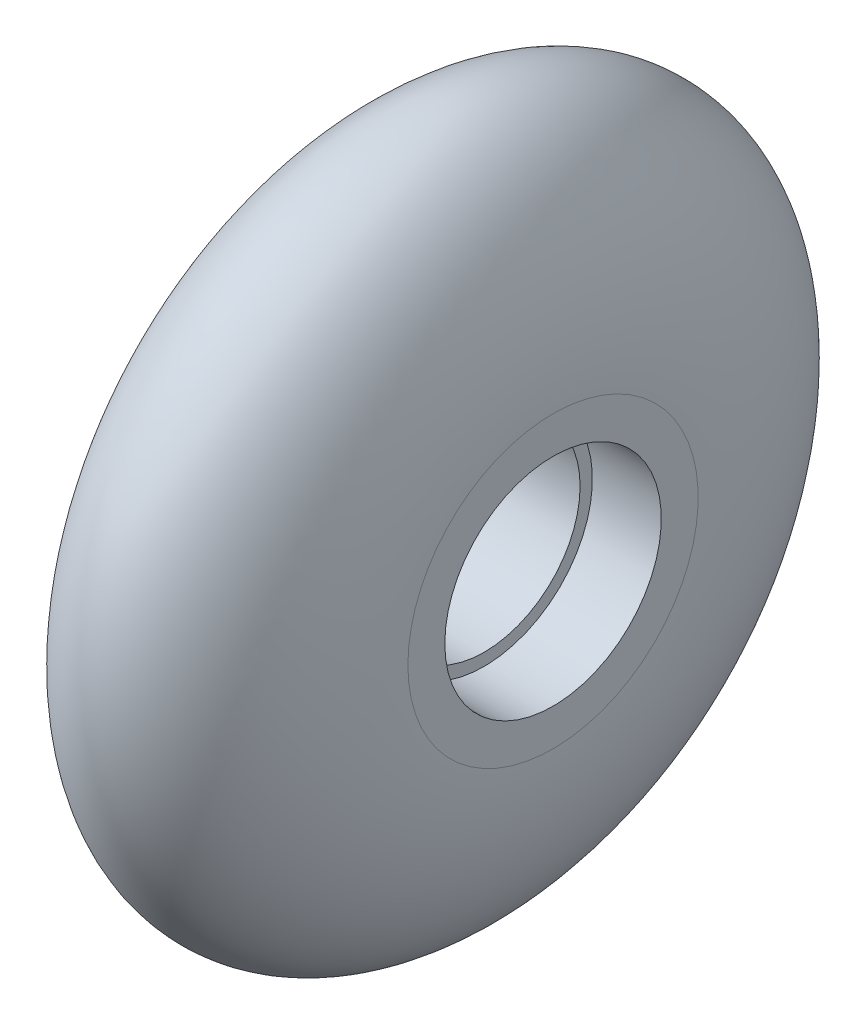
ISO-10303-21;
HEADER;
FILE_DESCRIPTION(('STEP AP214'),'2;1');
FILE_NAME('part.step','',(''),(''),'','','');
FILE_SCHEMA(('AUTOMOTIVE_DESIGN { 1 0 10303 214 1 1 1 1 }'));
ENDSEC;
DATA;
#1=APPLICATION_CONTEXT('core data for automotive mechanical design processes');
#2=APPLICATION_PROTOCOL_DEFINITION('international standard','automotive_design',2000,#1);
#3=PRODUCT_CONTEXT('',#1,'mechanical');
#4=PRODUCT('Part','Part','',(#3));
#5=PRODUCT_RELATED_PRODUCT_CATEGORY('part','',(#4));
#6=PRODUCT_DEFINITION_FORMATION('','',#4);
#7=PRODUCT_DEFINITION_CONTEXT('part definition',#1,'design');
#8=PRODUCT_DEFINITION('design','',#6,#7);
#9=PRODUCT_DEFINITION_SHAPE('','',#8);
#10=(LENGTH_UNIT() NAMED_UNIT(*) SI_UNIT(.MILLI.,.METRE.));
#11=(NAMED_UNIT(*) PLANE_ANGLE_UNIT() SI_UNIT($,.RADIAN.));
#12=(NAMED_UNIT(*) SI_UNIT($,.STERADIAN.) SOLID_ANGLE_UNIT());
#13=UNCERTAINTY_MEASURE_WITH_UNIT(LENGTH_MEASURE(1.E-05),#10,'distance_accuracy_value','');
#14=(GEOMETRIC_REPRESENTATION_CONTEXT(3) GLOBAL_UNCERTAINTY_ASSIGNED_CONTEXT((#13)) GLOBAL_UNIT_ASSIGNED_CONTEXT((#10,
#11,#12)) REPRESENTATION_CONTEXT('',''));
#15=CARTESIAN_POINT('',(0.,0.,0.));
#16=DIRECTION('',(0.,0.,1.));
#17=DIRECTION('',(1.,0.,0.));
#18=AXIS2_PLACEMENT_3D('',#15,#16,#17);
#19=CARTESIAN_POINT('',(0.,0.,0.));
#20=DIRECTION('',(-1.,0.,0.));
#21=DIRECTION('',(0.,0.,1.));
#22=AXIS2_PLACEMENT_3D('',#19,#20,#21);
#23=CYLINDRICAL_SURFACE('',#22,9.75);
#24=CARTESIAN_POINT('',(7.00000000000001,0.,0.));
#25=DIRECTION('',(-1.,0.,0.));
#26=DIRECTION('',(0.,0.,1.));
#27=AXIS2_PLACEMENT_3D('',#24,#25,#26);
#28=CIRCLE('',#27,9.75);
#29=CARTESIAN_POINT('',(7.00000000000001,0.,9.75));
#30=VERTEX_POINT('',#29);
#31=EDGE_CURVE('E56',#30,#30,#28,.F.);
#32=ORIENTED_EDGE('',*,*,#31,.F.);
#33=EDGE_LOOP('',(#32));
#34=FACE_BOUND('',#33,.T.);
#35=CARTESIAN_POINT('',(17.4,0.,0.));
#36=DIRECTION('',(1.,0.,0.));
#37=DIRECTION('',(0.,0.,-1.));
#38=AXIS2_PLACEMENT_3D('',#35,#36,#37);
#39=CIRCLE('',#38,9.75);
#40=CARTESIAN_POINT('',(17.4,0.,-9.75));
#41=VERTEX_POINT('',#40);
#42=EDGE_CURVE('E47',#41,#41,#39,.F.);
#43=ORIENTED_EDGE('',*,*,#42,.F.);
#44=EDGE_LOOP('',(#43));
#45=FACE_BOUND('',#44,.T.);
#46=ADVANCED_FACE('F44',(#34,#45),#23,.F.);
#47=CARTESIAN_POINT('',(0.,9.75,0.));
#48=DIRECTION('',(1.,0.,0.));
#49=DIRECTION('',(0.,0.,-1.));
#50=AXIS2_PLACEMENT_3D('',#47,#48,#49);
#51=PLANE('',#50);
#52=CARTESIAN_POINT('',(0.,0.,0.));
#53=DIRECTION('',(-1.,0.,0.));
#54=DIRECTION('',(0.,0.,1.));
#55=AXIS2_PLACEMENT_3D('',#52,#53,#54);
#56=CIRCLE('',#55,11.);
#57=CARTESIAN_POINT('',(0.,0.,11.));
#58=VERTEX_POINT('',#57);
#59=EDGE_CURVE('E64',#58,#58,#56,.T.);
#60=ORIENTED_EDGE('',*,*,#59,.F.);
#61=EDGE_LOOP('',(#60));
#62=FACE_BOUND('',#61,.T.);
#63=CARTESIAN_POINT('',(0.,0.,0.));
#64=DIRECTION('',(-1.,0.,0.));
#65=DIRECTION('',(0.,0.,1.));
#66=AXIS2_PLACEMENT_3D('',#63,#64,#65);
#67=CIRCLE('',#66,14.75);
#68=CARTESIAN_POINT('',(0.,0.,14.75));
#69=VERTEX_POINT('',#68);
#70=EDGE_CURVE('E12',#69,#69,#67,.T.);
#71=ORIENTED_EDGE('',*,*,#70,.T.);
#72=EDGE_LOOP('',(#71));
#73=FACE_BOUND('',#72,.T.);
#74=ADVANCED_FACE('F79',(#62,#73),#51,.F.);
#75=CARTESIAN_POINT('',(12.2,14.75,0.));
#76=DIRECTION('',(0.,0.,1.));
#77=DIRECTION('',(0.,-1.,0.));
#78=AXIS2_PLACEMENT_3D('',#75,#76,#77);
#79=ELLIPSE('',#78,21.25,12.2);
#80=TRIMMED_CURVE('',#79,(PARAMETER_VALUE(0.803602877341416)),
(PARAMETER_VALUE(5.47958242983817)),.T.,.PARAMETER.);
#81=CARTESIAN_POINT('',(0.,0.,0.));
#82=DIRECTION('',(-1.,0.,0.));
#83=AXIS1_PLACEMENT('',#81,#82);
#84=SURFACE_OF_REVOLUTION('',#80,#83);
#85=ORIENTED_EDGE('',*,*,#70,.F.);
#86=EDGE_LOOP('',(#85));
#87=FACE_BOUND('',#86,.T.);
#88=CARTESIAN_POINT('',(24.4,0.,0.));
#89=DIRECTION('',(-1.,0.,0.));
#90=DIRECTION('',(0.,0.,1.));
#91=AXIS2_PLACEMENT_3D('',#88,#89,#90);
#92=CIRCLE('',#91,14.75);
#93=CARTESIAN_POINT('',(24.4,0.,14.75));
#94=VERTEX_POINT('',#93);
#95=EDGE_CURVE('E51',#94,#94,#92,.T.);
#96=ORIENTED_EDGE('',*,*,#95,.T.);
#97=EDGE_LOOP('',(#96));
#98=FACE_BOUND('',#97,.T.);
#99=ADVANCED_FACE('F75',(#87,#98),#84,.T.);
#100=CARTESIAN_POINT('',(24.4,9.75,0.));
#101=DIRECTION('',(-1.,0.,0.));
#102=DIRECTION('',(0.,0.,1.));
#103=AXIS2_PLACEMENT_3D('',#100,#101,#102);
#104=PLANE('',#103);
#105=CARTESIAN_POINT('',(24.4,0.,0.));
#106=DIRECTION('',(-1.,0.,0.));
#107=DIRECTION('',(0.,0.,1.));
#108=AXIS2_PLACEMENT_3D('',#105,#106,#107);
#109=CIRCLE('',#108,11.);
#110=CARTESIAN_POINT('',(24.4,0.,11.));
#111=VERTEX_POINT('',#110);
#112=EDGE_CURVE('E71',#111,#111,#109,.T.);
#113=ORIENTED_EDGE('',*,*,#112,.T.);
#114=EDGE_LOOP('',(#113));
#115=FACE_BOUND('',#114,.T.);
#116=ORIENTED_EDGE('',*,*,#95,.F.);
#117=EDGE_LOOP('',(#116));
#118=FACE_BOUND('',#117,.T.);
#119=ADVANCED_FACE('F78',(#115,#118),#104,.F.);
#120=CARTESIAN_POINT('',(7.00000000000001,0.,0.));
#121=DIRECTION('',(-1.,0.,0.));
#122=DIRECTION('',(0.,0.,1.));
#123=AXIS2_PLACEMENT_3D('',#120,#121,#122);
#124=PLANE('',#123);
#125=CARTESIAN_POINT('',(7.00000000000001,0.,0.));
#126=DIRECTION('',(-1.,0.,0.));
#127=DIRECTION('',(0.,0.,1.));
#128=AXIS2_PLACEMENT_3D('',#125,#126,#127);
#129=CIRCLE('',#128,11.);
#130=CARTESIAN_POINT('',(7.00000000000001,0.,11.));
#131=VERTEX_POINT('',#130);
#132=EDGE_CURVE('E60',#131,#131,#129,.T.);
#133=ORIENTED_EDGE('',*,*,#132,.T.);
#134=EDGE_LOOP('',(#133));
#135=FACE_BOUND('',#134,.T.);
#136=ORIENTED_EDGE('',*,*,#31,.T.);
#137=EDGE_LOOP('',(#136));
#138=FACE_BOUND('',#137,.T.);
#139=ADVANCED_FACE('F93',(#135,#138),#124,.T.);
#140=CARTESIAN_POINT('',(7.00000000000001,0.,0.));
#141=DIRECTION('',(-1.,0.,0.));
#142=DIRECTION('',(0.,0.,1.));
#143=AXIS2_PLACEMENT_3D('',#140,#141,#142);
#144=CYLINDRICAL_SURFACE('',#143,11.);
#145=ORIENTED_EDGE('',*,*,#132,.F.);
#146=EDGE_LOOP('',(#145));
#147=FACE_BOUND('',#146,.T.);
#148=ORIENTED_EDGE('',*,*,#59,.T.);
#149=EDGE_LOOP('',(#148));
#150=FACE_BOUND('',#149,.T.);
#151=ADVANCED_FACE('F90',(#147,#150),#144,.F.);
#152=CARTESIAN_POINT('',(17.4,0.,0.));
#153=DIRECTION('',(1.,0.,0.));
#154=DIRECTION('',(0.,0.,1.));
#155=AXIS2_PLACEMENT_3D('',#152,#153,#154);
#156=PLANE('',#155);
#157=CARTESIAN_POINT('',(17.4,0.,0.));
#158=DIRECTION('',(-1.,0.,0.));
#159=DIRECTION('',(0.,0.,1.));
#160=AXIS2_PLACEMENT_3D('',#157,#158,#159);
#161=CIRCLE('',#160,11.);
#162=CARTESIAN_POINT('',(17.4,0.,11.));
#163=VERTEX_POINT('',#162);
#164=EDGE_CURVE('E111',#163,#163,#161,.T.);
#165=ORIENTED_EDGE('',*,*,#164,.F.);
#166=EDGE_LOOP('',(#165));
#167=FACE_BOUND('',#166,.T.);
#168=ORIENTED_EDGE('',*,*,#42,.T.);
#169=EDGE_LOOP('',(#168));
#170=FACE_BOUND('',#169,.T.);
#171=ADVANCED_FACE('F92',(#167,#170),#156,.T.);
#172=CARTESIAN_POINT('',(17.4,0.,0.));
#173=DIRECTION('',(1.,0.,0.));
#174=DIRECTION('',(0.,0.,-1.));
#175=AXIS2_PLACEMENT_3D('',#172,#173,#174);
#176=CYLINDRICAL_SURFACE('',#175,11.);
#177=ORIENTED_EDGE('',*,*,#164,.T.);
#178=EDGE_LOOP('',(#177));
#179=FACE_BOUND('',#178,.T.);
#180=ORIENTED_EDGE('',*,*,#112,.F.);
#181=EDGE_LOOP('',(#180));
#182=FACE_BOUND('',#181,.T.);
#183=ADVANCED_FACE('F99',(#179,#182),#176,.F.);
#184=CLOSED_SHELL('',(#46,#74,#99,#119,#139,#151,#171,#183));
#185=MANIFOLD_SOLID_BREP('B2',#184);
#186=ADVANCED_BREP_SHAPE_REPRESENTATION('',(#18,#185),#14);
#187=SHAPE_DEFINITION_REPRESENTATION(#9,#186);
ENDSEC;
END-ISO-10303-21;
